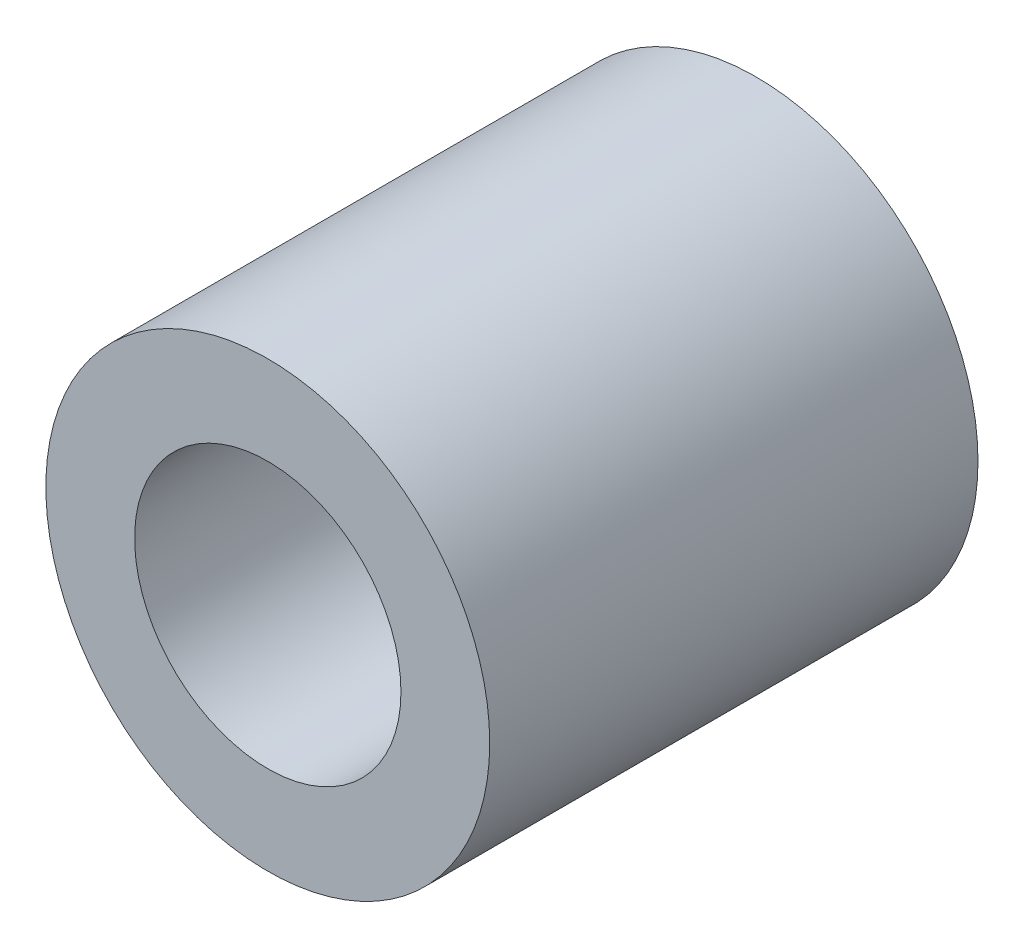
ISO-10303-21;
HEADER;
FILE_DESCRIPTION(('STEP AP214'),'2;1');
FILE_NAME('part.step','',(''),(''),'','','');
FILE_SCHEMA(('AUTOMOTIVE_DESIGN { 1 0 10303 214 1 1 1 1 }'));
ENDSEC;
DATA;
#1=APPLICATION_CONTEXT('core data for automotive mechanical design processes');
#2=APPLICATION_PROTOCOL_DEFINITION('international standard','automotive_design',2000,#1);
#3=PRODUCT_CONTEXT('',#1,'mechanical');
#4=PRODUCT('Part','Part','',(#3));
#5=PRODUCT_RELATED_PRODUCT_CATEGORY('part','',(#4));
#6=PRODUCT_DEFINITION_FORMATION('','',#4);
#7=PRODUCT_DEFINITION_CONTEXT('part definition',#1,'design');
#8=PRODUCT_DEFINITION('design','',#6,#7);
#9=PRODUCT_DEFINITION_SHAPE('','',#8);
#10=(LENGTH_UNIT() NAMED_UNIT(*) SI_UNIT(.MILLI.,.METRE.));
#11=(NAMED_UNIT(*) PLANE_ANGLE_UNIT() SI_UNIT($,.RADIAN.));
#12=(NAMED_UNIT(*) SI_UNIT($,.STERADIAN.) SOLID_ANGLE_UNIT());
#13=UNCERTAINTY_MEASURE_WITH_UNIT(LENGTH_MEASURE(1.E-05),#10,'distance_accuracy_value','');
#14=(GEOMETRIC_REPRESENTATION_CONTEXT(3) GLOBAL_UNCERTAINTY_ASSIGNED_CONTEXT((#13)) GLOBAL_UNIT_ASSIGNED_CONTEXT((#10,
#11,#12)) REPRESENTATION_CONTEXT('',''));
#15=CARTESIAN_POINT('',(0.,0.,0.));
#16=DIRECTION('',(0.,0.,1.));
#17=DIRECTION('',(1.,0.,0.));
#18=AXIS2_PLACEMENT_3D('',#15,#16,#17);
#19=CARTESIAN_POINT('',(0.,0.,5.5));
#20=DIRECTION('',(0.,0.,1.));
#21=DIRECTION('',(1.,0.,0.));
#22=AXIS2_PLACEMENT_3D('',#19,#20,#21);
#23=PLANE('',#22);
#24=CARTESIAN_POINT('',(0.,0.,5.5));
#25=DIRECTION('',(0.,0.,1.));
#26=DIRECTION('',(1.,0.,0.));
#27=AXIS2_PLACEMENT_3D('',#24,#25,#26);
#28=CIRCLE('',#27,2.5);
#29=CARTESIAN_POINT('',(2.5,0.,5.5));
#30=VERTEX_POINT('',#29);
#31=EDGE_CURVE('E10',#30,#30,#28,.T.);
#32=ORIENTED_EDGE('',*,*,#31,.T.);
#33=EDGE_LOOP('',(#32));
#34=FACE_BOUND('',#33,.T.);
#35=CARTESIAN_POINT('',(0.,0.,5.5));
#36=DIRECTION('',(0.,0.,1.));
#37=DIRECTION('',(1.,0.,0.));
#38=AXIS2_PLACEMENT_3D('',#35,#36,#37);
#39=CIRCLE('',#38,1.5);
#40=CARTESIAN_POINT('',(1.5,0.,5.5));
#41=VERTEX_POINT('',#40);
#42=EDGE_CURVE('E44',#41,#41,#39,.T.);
#43=ORIENTED_EDGE('',*,*,#42,.F.);
#44=EDGE_LOOP('',(#43));
#45=FACE_BOUND('',#44,.T.);
#46=ADVANCED_FACE('F33',(#34,#45),#23,.T.);
#47=CARTESIAN_POINT('',(0.,0.,0.));
#48=DIRECTION('',(0.,0.,1.));
#49=DIRECTION('',(1.,0.,0.));
#50=AXIS2_PLACEMENT_3D('',#47,#48,#49);
#51=PLANE('',#50);
#52=CARTESIAN_POINT('',(0.,0.,0.));
#53=DIRECTION('',(0.,0.,1.));
#54=DIRECTION('',(1.,0.,0.));
#55=AXIS2_PLACEMENT_3D('',#52,#53,#54);
#56=CIRCLE('',#55,2.5);
#57=CARTESIAN_POINT('',(2.5,0.,0.));
#58=VERTEX_POINT('',#57);
#59=EDGE_CURVE('E37',#58,#58,#56,.T.);
#60=ORIENTED_EDGE('',*,*,#59,.F.);
#61=EDGE_LOOP('',(#60));
#62=FACE_BOUND('',#61,.T.);
#63=CARTESIAN_POINT('',(0.,0.,0.));
#64=DIRECTION('',(0.,0.,1.));
#65=DIRECTION('',(1.,0.,0.));
#66=AXIS2_PLACEMENT_3D('',#63,#64,#65);
#67=CIRCLE('',#66,1.5);
#68=CARTESIAN_POINT('',(1.5,0.,0.));
#69=VERTEX_POINT('',#68);
#70=EDGE_CURVE('E46',#69,#69,#67,.T.);
#71=ORIENTED_EDGE('',*,*,#70,.T.);
#72=EDGE_LOOP('',(#71));
#73=FACE_BOUND('',#72,.T.);
#74=ADVANCED_FACE('F56',(#62,#73),#51,.F.);
#75=CARTESIAN_POINT('',(0.,0.,5.5));
#76=DIRECTION('',(0.,0.,-1.));
#77=DIRECTION('',(-1.,0.,0.));
#78=AXIS2_PLACEMENT_3D('',#75,#76,#77);
#79=CYLINDRICAL_SURFACE('',#78,2.5);
#80=ORIENTED_EDGE('',*,*,#31,.F.);
#81=EDGE_LOOP('',(#80));
#82=FACE_BOUND('',#81,.T.);
#83=ORIENTED_EDGE('',*,*,#59,.T.);
#84=EDGE_LOOP('',(#83));
#85=FACE_BOUND('',#84,.T.);
#86=ADVANCED_FACE('F35',(#82,#85),#79,.T.);
#87=CARTESIAN_POINT('',(0.,0.,5.5));
#88=DIRECTION('',(0.,0.,-1.));
#89=DIRECTION('',(-1.,0.,0.));
#90=AXIS2_PLACEMENT_3D('',#87,#88,#89);
#91=CYLINDRICAL_SURFACE('',#90,1.5);
#92=ORIENTED_EDGE('',*,*,#42,.T.);
#93=EDGE_LOOP('',(#92));
#94=FACE_BOUND('',#93,.T.);
#95=ORIENTED_EDGE('',*,*,#70,.F.);
#96=EDGE_LOOP('',(#95));
#97=FACE_BOUND('',#96,.T.);
#98=ADVANCED_FACE('F52',(#94,#97),#91,.F.);
#99=CLOSED_SHELL('',(#46,#74,#86,#98));
#100=MANIFOLD_SOLID_BREP('B2',#99);
#101=ADVANCED_BREP_SHAPE_REPRESENTATION('',(#18,#100),#14);
#102=SHAPE_DEFINITION_REPRESENTATION(#9,#101);
ENDSEC;
END-ISO-10303-21;
